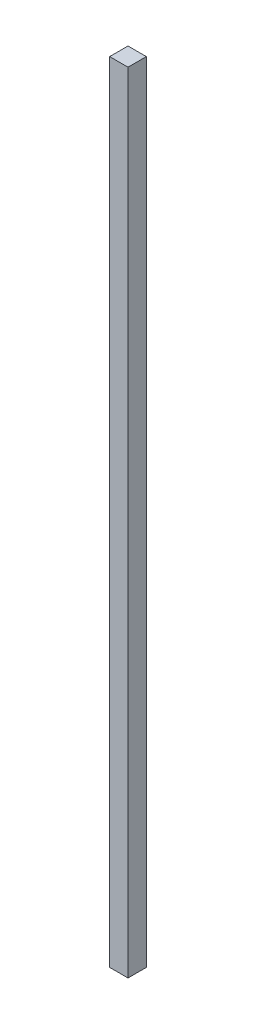
ISO-10303-21;
HEADER;
FILE_DESCRIPTION(('STEP AP214'),'2;1');
FILE_NAME('part.step','',(''),(''),'','','');
FILE_SCHEMA(('AUTOMOTIVE_DESIGN { 1 0 10303 214 1 1 1 1 }'));
ENDSEC;
DATA;
#1=APPLICATION_CONTEXT('core data for automotive mechanical design processes');
#2=APPLICATION_PROTOCOL_DEFINITION('international standard','automotive_design',2000,#1);
#3=PRODUCT_CONTEXT('',#1,'mechanical');
#4=PRODUCT('Part','Part','',(#3));
#5=PRODUCT_RELATED_PRODUCT_CATEGORY('part','',(#4));
#6=PRODUCT_DEFINITION_FORMATION('','',#4);
#7=PRODUCT_DEFINITION_CONTEXT('part definition',#1,'design');
#8=PRODUCT_DEFINITION('design','',#6,#7);
#9=PRODUCT_DEFINITION_SHAPE('','',#8);
#10=(LENGTH_UNIT() NAMED_UNIT(*) SI_UNIT(.MILLI.,.METRE.));
#11=(NAMED_UNIT(*) PLANE_ANGLE_UNIT() SI_UNIT($,.RADIAN.));
#12=(NAMED_UNIT(*) SI_UNIT($,.STERADIAN.) SOLID_ANGLE_UNIT());
#13=UNCERTAINTY_MEASURE_WITH_UNIT(LENGTH_MEASURE(1.E-05),#10,'distance_accuracy_value','');
#14=(GEOMETRIC_REPRESENTATION_CONTEXT(3) GLOBAL_UNCERTAINTY_ASSIGNED_CONTEXT((#13)) GLOBAL_UNIT_ASSIGNED_CONTEXT((#10,
#11,#12)) REPRESENTATION_CONTEXT('',''));
#15=CARTESIAN_POINT('',(0.,0.,0.));
#16=DIRECTION('',(0.,0.,1.));
#17=DIRECTION('',(1.,0.,0.));
#18=AXIS2_PLACEMENT_3D('',#15,#16,#17);
#19=CARTESIAN_POINT('',(-12.7,1092.2,12.7));
#20=DIRECTION('',(-1.,0.,0.));
#21=DIRECTION('',(0.,0.,1.));
#22=AXIS2_PLACEMENT_3D('',#19,#20,#21);
#23=PLANE('',#22);
#24=DIRECTION('',(0.,0.,-1.));
#25=VECTOR('',#24,1.);
#26=CARTESIAN_POINT('',(-12.7,0.,12.7));
#27=LINE('',#26,#25);
#28=CARTESIAN_POINT('',(-12.7,0.,12.7));
#29=VERTEX_POINT('',#28);
#30=CARTESIAN_POINT('',(-12.7,0.,-12.7));
#31=VERTEX_POINT('',#30);
#32=EDGE_CURVE('E125',#29,#31,#27,.T.);
#33=ORIENTED_EDGE('',*,*,#32,.F.);
#34=DIRECTION('',(0.,-1.,0.));
#35=VECTOR('',#34,1.);
#36=CARTESIAN_POINT('',(-12.7,1092.2,12.7));
#37=LINE('',#36,#35);
#38=CARTESIAN_POINT('',(-12.7,1092.2,12.7));
#39=VERTEX_POINT('',#38);
#40=EDGE_CURVE('E11',#39,#29,#37,.T.);
#41=ORIENTED_EDGE('',*,*,#40,.F.);
#42=DIRECTION('',(0.,0.,-1.));
#43=VECTOR('',#42,1.);
#44=CARTESIAN_POINT('',(-12.7,1092.2,12.7));
#45=LINE('',#44,#43);
#46=CARTESIAN_POINT('',(-12.7,1092.2,-12.7));
#47=VERTEX_POINT('',#46);
#48=EDGE_CURVE('E116',#39,#47,#45,.T.);
#49=ORIENTED_EDGE('',*,*,#48,.T.);
#50=DIRECTION('',(0.,-1.,0.));
#51=VECTOR('',#50,1.);
#52=CARTESIAN_POINT('',(-12.7,1092.2,-12.7));
#53=LINE('',#52,#51);
#54=EDGE_CURVE('E47',#47,#31,#53,.T.);
#55=ORIENTED_EDGE('',*,*,#54,.T.);
#56=EDGE_LOOP('',(#33,#41,#49,#55));
#57=FACE_BOUND('',#56,.T.);
#58=ADVANCED_FACE('F44',(#57),#23,.T.);
#59=CARTESIAN_POINT('',(-12.7,1092.2,12.7));
#60=DIRECTION('',(0.,0.,-1.));
#61=DIRECTION('',(-1.,0.,0.));
#62=AXIS2_PLACEMENT_3D('',#59,#60,#61);
#63=PLANE('',#62);
#64=DIRECTION('',(1.,0.,0.));
#65=VECTOR('',#64,1.);
#66=CARTESIAN_POINT('',(-12.7,0.,12.7));
#67=LINE('',#66,#65);
#68=CARTESIAN_POINT('',(12.7,0.,12.7));
#69=VERTEX_POINT('',#68);
#70=EDGE_CURVE('E85',#29,#69,#67,.T.);
#71=ORIENTED_EDGE('',*,*,#70,.T.);
#72=DIRECTION('',(0.,-1.,0.));
#73=VECTOR('',#72,1.);
#74=CARTESIAN_POINT('',(12.7,1092.2,12.7));
#75=LINE('',#74,#73);
#76=CARTESIAN_POINT('',(12.7,1092.2,12.7));
#77=VERTEX_POINT('',#76);
#78=EDGE_CURVE('E54',#77,#69,#75,.T.);
#79=ORIENTED_EDGE('',*,*,#78,.F.);
#80=DIRECTION('',(1.,0.,0.));
#81=VECTOR('',#80,1.);
#82=CARTESIAN_POINT('',(-12.7,1092.2,12.7));
#83=LINE('',#82,#81);
#84=EDGE_CURVE('E103',#39,#77,#83,.T.);
#85=ORIENTED_EDGE('',*,*,#84,.F.);
#86=ORIENTED_EDGE('',*,*,#40,.T.);
#87=EDGE_LOOP('',(#71,#79,#85,#86));
#88=FACE_BOUND('',#87,.T.);
#89=ADVANCED_FACE('F151',(#88),#63,.F.);
#90=CARTESIAN_POINT('',(12.7,1092.2,12.7));
#91=DIRECTION('',(-1.,0.,0.));
#92=DIRECTION('',(0.,0.,1.));
#93=AXIS2_PLACEMENT_3D('',#90,#91,#92);
#94=PLANE('',#93);
#95=DIRECTION('',(0.,0.,-1.));
#96=VECTOR('',#95,1.);
#97=CARTESIAN_POINT('',(12.7,0.,12.7));
#98=LINE('',#97,#96);
#99=CARTESIAN_POINT('',(12.7,0.,-12.7));
#100=VERTEX_POINT('',#99);
#101=EDGE_CURVE('E111',#69,#100,#98,.T.);
#102=ORIENTED_EDGE('',*,*,#101,.T.);
#103=DIRECTION('',(0.,-1.,0.));
#104=VECTOR('',#103,1.);
#105=CARTESIAN_POINT('',(12.7,1092.2,-12.7));
#106=LINE('',#105,#104);
#107=CARTESIAN_POINT('',(12.7,1092.2,-12.7));
#108=VERTEX_POINT('',#107);
#109=EDGE_CURVE('E108',#108,#100,#106,.T.);
#110=ORIENTED_EDGE('',*,*,#109,.F.);
#111=DIRECTION('',(0.,0.,-1.));
#112=VECTOR('',#111,1.);
#113=CARTESIAN_POINT('',(12.7,1092.2,12.7));
#114=LINE('',#113,#112);
#115=EDGE_CURVE('E98',#77,#108,#114,.T.);
#116=ORIENTED_EDGE('',*,*,#115,.F.);
#117=ORIENTED_EDGE('',*,*,#78,.T.);
#118=EDGE_LOOP('',(#102,#110,#116,#117));
#119=FACE_BOUND('',#118,.T.);
#120=ADVANCED_FACE('F109',(#119),#94,.F.);
#121=CARTESIAN_POINT('',(-12.7,1092.2,-12.7));
#122=DIRECTION('',(0.,0.,-1.));
#123=DIRECTION('',(-1.,0.,0.));
#124=AXIS2_PLACEMENT_3D('',#121,#122,#123);
#125=PLANE('',#124);
#126=DIRECTION('',(1.,0.,0.));
#127=VECTOR('',#126,1.);
#128=CARTESIAN_POINT('',(-12.7,0.,-12.7));
#129=LINE('',#128,#127);
#130=EDGE_CURVE('E129',#31,#100,#129,.T.);
#131=ORIENTED_EDGE('',*,*,#130,.F.);
#132=ORIENTED_EDGE('',*,*,#54,.F.);
#133=DIRECTION('',(1.,0.,0.));
#134=VECTOR('',#133,1.);
#135=CARTESIAN_POINT('',(-12.7,1092.2,-12.7));
#136=LINE('',#135,#134);
#137=EDGE_CURVE('E102',#47,#108,#136,.T.);
#138=ORIENTED_EDGE('',*,*,#137,.T.);
#139=ORIENTED_EDGE('',*,*,#109,.T.);
#140=EDGE_LOOP('',(#131,#132,#138,#139));
#141=FACE_BOUND('',#140,.T.);
#142=ADVANCED_FACE('F114',(#141),#125,.T.);
#143=CARTESIAN_POINT('',(0.,1092.2,0.));
#144=DIRECTION('',(0.,-1.,0.));
#145=DIRECTION('',(0.,0.,-1.));
#146=AXIS2_PLACEMENT_3D('',#143,#144,#145);
#147=PLANE('',#146);
#148=ORIENTED_EDGE('',*,*,#48,.F.);
#149=ORIENTED_EDGE('',*,*,#84,.T.);
#150=ORIENTED_EDGE('',*,*,#115,.T.);
#151=ORIENTED_EDGE('',*,*,#137,.F.);
#152=EDGE_LOOP('',(#148,#149,#150,#151));
#153=FACE_BOUND('',#152,.T.);
#154=ADVANCED_FACE('F101',(#153),#147,.F.);
#155=CARTESIAN_POINT('',(0.,0.,0.));
#156=DIRECTION('',(0.,-1.,0.));
#157=DIRECTION('',(0.,0.,-1.));
#158=AXIS2_PLACEMENT_3D('',#155,#156,#157);
#159=PLANE('',#158);
#160=ORIENTED_EDGE('',*,*,#32,.T.);
#161=ORIENTED_EDGE('',*,*,#130,.T.);
#162=ORIENTED_EDGE('',*,*,#101,.F.);
#163=ORIENTED_EDGE('',*,*,#70,.F.);
#164=EDGE_LOOP('',(#160,#161,#162,#163));
#165=FACE_BOUND('',#164,.T.);
#166=ADVANCED_FACE('F139',(#165),#159,.T.);
#167=CLOSED_SHELL('',(#58,#89,#120,#142,#154,#166));
#168=MANIFOLD_SOLID_BREP('B2',#167);
#169=ADVANCED_BREP_SHAPE_REPRESENTATION('',(#18,#168),#14);
#170=SHAPE_DEFINITION_REPRESENTATION(#9,#169);
ENDSEC;
END-ISO-10303-21;
